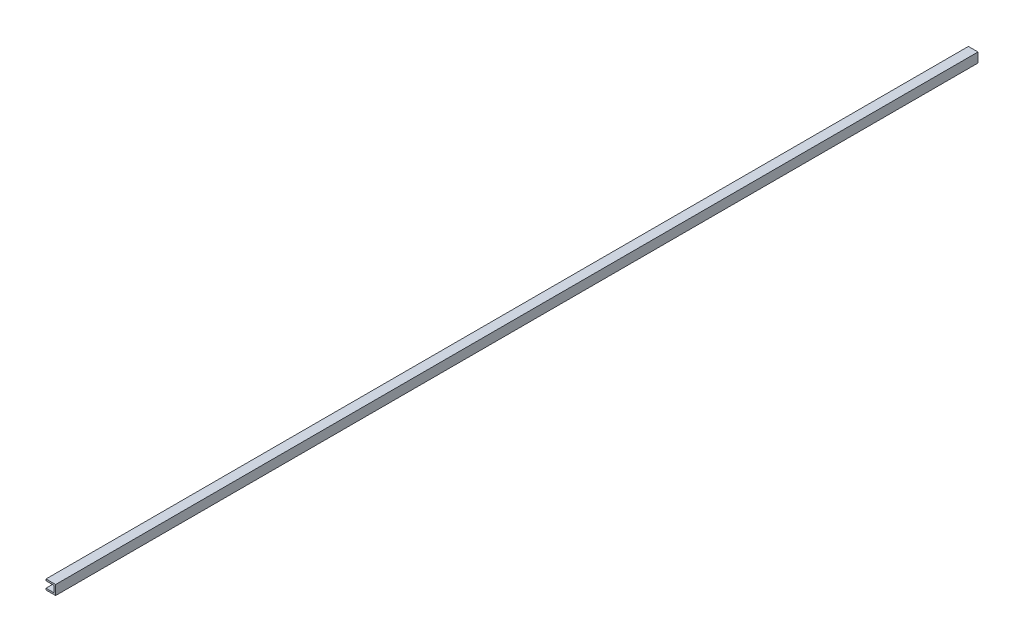
ISO-10303-21;
HEADER;
FILE_DESCRIPTION(('STEP AP214'),'2;1');
FILE_NAME('part.step','',(''),(''),'','','');
FILE_SCHEMA(('AUTOMOTIVE_DESIGN { 1 0 10303 214 1 1 1 1 }'));
ENDSEC;
DATA;
#1=APPLICATION_CONTEXT('core data for automotive mechanical design processes');
#2=APPLICATION_PROTOCOL_DEFINITION('international standard','automotive_design',2000,#1);
#3=PRODUCT_CONTEXT('',#1,'mechanical');
#4=PRODUCT('Part','Part','',(#3));
#5=PRODUCT_RELATED_PRODUCT_CATEGORY('part','',(#4));
#6=PRODUCT_DEFINITION_FORMATION('','',#4);
#7=PRODUCT_DEFINITION_CONTEXT('part definition',#1,'design');
#8=PRODUCT_DEFINITION('design','',#6,#7);
#9=PRODUCT_DEFINITION_SHAPE('','',#8);
#10=(LENGTH_UNIT() NAMED_UNIT(*) SI_UNIT(.MILLI.,.METRE.));
#11=(NAMED_UNIT(*) PLANE_ANGLE_UNIT() SI_UNIT($,.RADIAN.));
#12=(NAMED_UNIT(*) SI_UNIT($,.STERADIAN.) SOLID_ANGLE_UNIT());
#13=UNCERTAINTY_MEASURE_WITH_UNIT(LENGTH_MEASURE(1.E-05),#10,'distance_accuracy_value','');
#14=(GEOMETRIC_REPRESENTATION_CONTEXT(3) GLOBAL_UNCERTAINTY_ASSIGNED_CONTEXT((#13)) GLOBAL_UNIT_ASSIGNED_CONTEXT((#10,
#11,#12)) REPRESENTATION_CONTEXT('',''));
#15=CARTESIAN_POINT('',(0.,0.,0.));
#16=DIRECTION('',(0.,0.,1.));
#17=DIRECTION('',(1.,0.,0.));
#18=AXIS2_PLACEMENT_3D('',#15,#16,#17);
#19=CARTESIAN_POINT('',(-16.8284787136374,19.5792892826044,0.));
#20=DIRECTION('',(0.,1.,0.));
#21=DIRECTION('',(0.,0.,1.));
#22=AXIS2_PLACEMENT_3D('',#19,#20,#21);
#23=PLANE('',#22);
#24=DIRECTION('',(1.,0.,0.));
#25=VECTOR('',#24,1.);
#26=CARTESIAN_POINT('',(-7.30347871363741,19.5792892826044,1828.8));
#27=LINE('',#26,#25);
#28=CARTESIAN_POINT('',(2.22152128636259,19.5792892826044,1828.8));
#29=VERTEX_POINT('',#28);
#30=CARTESIAN_POINT('',(-16.8284787136374,19.5792892826044,1828.8));
#31=VERTEX_POINT('',#30);
#32=EDGE_CURVE('E127',#29,#31,#27,.F.);
#33=ORIENTED_EDGE('',*,*,#32,.F.);
#34=DIRECTION('',(0.,0.,-1.));
#35=VECTOR('',#34,1.);
#36=CARTESIAN_POINT('',(2.22152128636259,19.5792892826044,0.));
#37=LINE('',#36,#35);
#38=CARTESIAN_POINT('',(2.22152128636259,19.5792892826044,0.));
#39=VERTEX_POINT('',#38);
#40=EDGE_CURVE('E122',#39,#29,#37,.F.);
#41=ORIENTED_EDGE('',*,*,#40,.F.);
#42=DIRECTION('',(1.,0.,0.));
#43=VECTOR('',#42,1.);
#44=CARTESIAN_POINT('',(-7.30347871363741,19.5792892826044,0.));
#45=LINE('',#44,#43);
#46=CARTESIAN_POINT('',(-16.8284787136374,19.5792892826044,0.));
#47=VERTEX_POINT('',#46);
#48=EDGE_CURVE('E105',#39,#47,#45,.F.);
#49=ORIENTED_EDGE('',*,*,#48,.T.);
#50=DIRECTION('',(0.,0.,1.));
#51=VECTOR('',#50,1.);
#52=CARTESIAN_POINT('',(-16.8284787136374,19.5792892826044,0.));
#53=LINE('',#52,#51);
#54=EDGE_CURVE('E20',#31,#47,#53,.F.);
#55=ORIENTED_EDGE('',*,*,#54,.F.);
#56=EDGE_LOOP('',(#33,#41,#49,#55));
#57=FACE_BOUND('',#56,.T.);
#58=ADVANCED_FACE('F17',(#57),#23,.T.);
#59=CARTESIAN_POINT('',(-16.8284787136374,16.4042892826044,0.));
#60=DIRECTION('',(-1.,0.,0.));
#61=DIRECTION('',(0.,0.,1.));
#62=AXIS2_PLACEMENT_3D('',#59,#60,#61);
#63=PLANE('',#62);
#64=DIRECTION('',(0.,0.,1.));
#65=VECTOR('',#64,1.);
#66=CARTESIAN_POINT('',(-16.8284787136374,16.4042892826044,0.));
#67=LINE('',#66,#65);
#68=CARTESIAN_POINT('',(-16.8284787136374,16.4042892826044,0.));
#69=VERTEX_POINT('',#68);
#70=CARTESIAN_POINT('',(-16.8284787136374,16.4042892826044,1828.8));
#71=VERTEX_POINT('',#70);
#72=EDGE_CURVE('E79',#69,#71,#67,.T.);
#73=ORIENTED_EDGE('',*,*,#72,.T.);
#74=DIRECTION('',(0.,1.,0.));
#75=VECTOR('',#74,1.);
#76=CARTESIAN_POINT('',(-16.8284787136374,10.0542892826044,1828.8));
#77=LINE('',#76,#75);
#78=EDGE_CURVE('E115',#31,#71,#77,.F.);
#79=ORIENTED_EDGE('',*,*,#78,.F.);
#80=ORIENTED_EDGE('',*,*,#54,.T.);
#81=DIRECTION('',(0.,1.,0.));
#82=VECTOR('',#81,1.);
#83=CARTESIAN_POINT('',(-16.8284787136374,10.0542892826044,0.));
#84=LINE('',#83,#82);
#85=EDGE_CURVE('E113',#47,#69,#84,.F.);
#86=ORIENTED_EDGE('',*,*,#85,.T.);
#87=EDGE_LOOP('',(#73,#79,#80,#86));
#88=FACE_BOUND('',#87,.T.);
#89=ADVANCED_FACE('F112',(#88),#63,.T.);
#90=CARTESIAN_POINT('',(-16.8284787136374,16.4042892826044,0.));
#91=DIRECTION('',(0.,1.,0.));
#92=DIRECTION('',(0.,0.,1.));
#93=AXIS2_PLACEMENT_3D('',#90,#91,#92);
#94=PLANE('',#93);
#95=DIRECTION('',(1.,0.,0.));
#96=VECTOR('',#95,1.);
#97=CARTESIAN_POINT('',(-7.30347871363741,16.4042892826044,0.));
#98=LINE('',#97,#96);
#99=CARTESIAN_POINT('',(-0.953478713637413,16.4042892826044,0.));
#100=VERTEX_POINT('',#99);
#101=EDGE_CURVE('E82',#69,#100,#98,.T.);
#102=ORIENTED_EDGE('',*,*,#101,.T.);
#103=DIRECTION('',(0.,0.,-1.));
#104=VECTOR('',#103,1.);
#105=CARTESIAN_POINT('',(-0.953478713637413,16.4042892826044,0.));
#106=LINE('',#105,#104);
#107=CARTESIAN_POINT('',(-0.953478713637413,16.4042892826044,1828.8));
#108=VERTEX_POINT('',#107);
#109=EDGE_CURVE('E85',#100,#108,#106,.F.);
#110=ORIENTED_EDGE('',*,*,#109,.T.);
#111=DIRECTION('',(1.,0.,0.));
#112=VECTOR('',#111,1.);
#113=CARTESIAN_POINT('',(-7.30347871363741,16.4042892826044,1828.8));
#114=LINE('',#113,#112);
#115=EDGE_CURVE('E130',#71,#108,#114,.T.);
#116=ORIENTED_EDGE('',*,*,#115,.F.);
#117=ORIENTED_EDGE('',*,*,#72,.F.);
#118=EDGE_LOOP('',(#102,#110,#116,#117));
#119=FACE_BOUND('',#118,.T.);
#120=ADVANCED_FACE('F84',(#119),#94,.F.);
#121=CARTESIAN_POINT('',(-0.953478713637413,16.4042892826044,0.));
#122=DIRECTION('',(1.,0.,0.));
#123=DIRECTION('',(0.,0.,-1.));
#124=AXIS2_PLACEMENT_3D('',#121,#122,#123);
#125=PLANE('',#124);
#126=DIRECTION('',(0.,1.,0.));
#127=VECTOR('',#126,1.);
#128=CARTESIAN_POINT('',(-0.953478713637413,10.0542892826044,0.));
#129=LINE('',#128,#127);
#130=CARTESIAN_POINT('',(-0.953478713637413,3.70428928260443,0.));
#131=VERTEX_POINT('',#130);
#132=EDGE_CURVE('E90',#100,#131,#129,.F.);
#133=ORIENTED_EDGE('',*,*,#132,.T.);
#134=DIRECTION('',(0.,0.,-1.));
#135=VECTOR('',#134,1.);
#136=CARTESIAN_POINT('',(-0.953478713637413,3.70428928260443,0.));
#137=LINE('',#136,#135);
#138=CARTESIAN_POINT('',(-0.953478713637413,3.70428928260443,1828.8));
#139=VERTEX_POINT('',#138);
#140=EDGE_CURVE('E91',#131,#139,#137,.F.);
#141=ORIENTED_EDGE('',*,*,#140,.T.);
#142=DIRECTION('',(0.,1.,0.));
#143=VECTOR('',#142,1.);
#144=CARTESIAN_POINT('',(-0.953478713637413,10.0542892826044,1828.8));
#145=LINE('',#144,#143);
#146=EDGE_CURVE('E97',#108,#139,#145,.F.);
#147=ORIENTED_EDGE('',*,*,#146,.F.);
#148=ORIENTED_EDGE('',*,*,#109,.F.);
#149=EDGE_LOOP('',(#133,#141,#147,#148));
#150=FACE_BOUND('',#149,.T.);
#151=ADVANCED_FACE('F94',(#150),#125,.F.);
#152=CARTESIAN_POINT('',(-0.953478713637413,3.70428928260443,0.));
#153=DIRECTION('',(0.,-1.,0.));
#154=DIRECTION('',(0.,0.,-1.));
#155=AXIS2_PLACEMENT_3D('',#152,#153,#154);
#156=PLANE('',#155);
#157=DIRECTION('',(1.,0.,0.));
#158=VECTOR('',#157,1.);
#159=CARTESIAN_POINT('',(-7.30347871363741,3.70428928260443,0.));
#160=LINE('',#159,#158);
#161=CARTESIAN_POINT('',(-16.8284787136374,3.70428928260443,0.));
#162=VERTEX_POINT('',#161);
#163=EDGE_CURVE('E103',#131,#162,#160,.F.);
#164=ORIENTED_EDGE('',*,*,#163,.T.);
#165=DIRECTION('',(0.,0.,1.));
#166=VECTOR('',#165,1.);
#167=CARTESIAN_POINT('',(-16.8284787136374,3.70428928260443,0.));
#168=LINE('',#167,#166);
#169=CARTESIAN_POINT('',(-16.8284787136374,3.70428928260443,1828.8));
#170=VERTEX_POINT('',#169);
#171=EDGE_CURVE('E139',#170,#162,#168,.F.);
#172=ORIENTED_EDGE('',*,*,#171,.F.);
#173=DIRECTION('',(1.,0.,0.));
#174=VECTOR('',#173,1.);
#175=CARTESIAN_POINT('',(-7.30347871363741,3.70428928260443,1828.8));
#176=LINE('',#175,#174);
#177=EDGE_CURVE('E133',#139,#170,#176,.F.);
#178=ORIENTED_EDGE('',*,*,#177,.F.);
#179=ORIENTED_EDGE('',*,*,#140,.F.);
#180=EDGE_LOOP('',(#164,#172,#178,#179));
#181=FACE_BOUND('',#180,.T.);
#182=ADVANCED_FACE('F178',(#181),#156,.F.);
#183=CARTESIAN_POINT('',(-7.30347871363741,10.0542892826044,0.));
#184=DIRECTION('',(0.,0.,1.));
#185=DIRECTION('',(1.,0.,0.));
#186=AXIS2_PLACEMENT_3D('',#183,#184,#185);
#187=PLANE('',#186);
#188=ORIENTED_EDGE('',*,*,#48,.F.);
#189=DIRECTION('',(0.,1.,0.));
#190=VECTOR('',#189,1.);
#191=CARTESIAN_POINT('',(2.22152128636259,19.5792892826044,0.));
#192=LINE('',#191,#190);
#193=CARTESIAN_POINT('',(2.22152128636259,0.529289282604433,0.));
#194=VERTEX_POINT('',#193);
#195=EDGE_CURVE('E119',#194,#39,#192,.T.);
#196=ORIENTED_EDGE('',*,*,#195,.F.);
#197=DIRECTION('',(1.,0.,0.));
#198=VECTOR('',#197,1.);
#199=CARTESIAN_POINT('',(2.22152128636259,0.529289282604433,0.));
#200=LINE('',#199,#198);
#201=CARTESIAN_POINT('',(-16.8284787136374,0.529289282604433,0.));
#202=VERTEX_POINT('',#201);
#203=EDGE_CURVE('E145',#202,#194,#200,.T.);
#204=ORIENTED_EDGE('',*,*,#203,.F.);
#205=DIRECTION('',(0.,1.,0.));
#206=VECTOR('',#205,1.);
#207=CARTESIAN_POINT('',(-16.8284787136374,16.4042892826044,0.));
#208=LINE('',#207,#206);
#209=EDGE_CURVE('E142',#162,#202,#208,.F.);
#210=ORIENTED_EDGE('',*,*,#209,.F.);
#211=ORIENTED_EDGE('',*,*,#163,.F.);
#212=ORIENTED_EDGE('',*,*,#132,.F.);
#213=ORIENTED_EDGE('',*,*,#101,.F.);
#214=ORIENTED_EDGE('',*,*,#85,.F.);
#215=EDGE_LOOP('',(#188,#196,#204,#210,#211,#212,#213,#214));
#216=FACE_BOUND('',#215,.T.);
#217=ADVANCED_FACE('F101',(#216),#187,.F.);
#218=CARTESIAN_POINT('',(2.22152128636259,19.5792892826044,0.));
#219=DIRECTION('',(1.,0.,0.));
#220=DIRECTION('',(0.,0.,-1.));
#221=AXIS2_PLACEMENT_3D('',#218,#219,#220);
#222=PLANE('',#221);
#223=DIRECTION('',(0.,1.,0.));
#224=VECTOR('',#223,1.);
#225=CARTESIAN_POINT('',(2.22152128636259,10.0542892826044,1828.8));
#226=LINE('',#225,#224);
#227=CARTESIAN_POINT('',(2.22152128636259,0.529289282604432,1828.8));
#228=VERTEX_POINT('',#227);
#229=EDGE_CURVE('E135',#228,#29,#226,.T.);
#230=ORIENTED_EDGE('',*,*,#229,.F.);
#231=DIRECTION('',(0.,0.,-1.));
#232=VECTOR('',#231,1.);
#233=CARTESIAN_POINT('',(2.22152128636259,0.529289282604433,0.));
#234=LINE('',#233,#232);
#235=EDGE_CURVE('E148',#194,#228,#234,.F.);
#236=ORIENTED_EDGE('',*,*,#235,.F.);
#237=ORIENTED_EDGE('',*,*,#195,.T.);
#238=ORIENTED_EDGE('',*,*,#40,.T.);
#239=EDGE_LOOP('',(#230,#236,#237,#238));
#240=FACE_BOUND('',#239,.T.);
#241=ADVANCED_FACE('F157',(#240),#222,.T.);
#242=CARTESIAN_POINT('',(-7.30347871363741,10.0542892826044,1828.8));
#243=DIRECTION('',(0.,0.,1.));
#244=DIRECTION('',(1.,0.,0.));
#245=AXIS2_PLACEMENT_3D('',#242,#243,#244);
#246=PLANE('',#245);
#247=DIRECTION('',(1.,0.,0.));
#248=VECTOR('',#247,1.);
#249=CARTESIAN_POINT('',(2.22152128636259,0.529289282604433,1828.8));
#250=LINE('',#249,#248);
#251=CARTESIAN_POINT('',(-16.8284787136374,0.529289282604433,1828.8));
#252=VERTEX_POINT('',#251);
#253=EDGE_CURVE('E26',#228,#252,#250,.F.);
#254=ORIENTED_EDGE('',*,*,#253,.F.);
#255=ORIENTED_EDGE('',*,*,#229,.T.);
#256=ORIENTED_EDGE('',*,*,#32,.T.);
#257=ORIENTED_EDGE('',*,*,#78,.T.);
#258=ORIENTED_EDGE('',*,*,#115,.T.);
#259=ORIENTED_EDGE('',*,*,#146,.T.);
#260=ORIENTED_EDGE('',*,*,#177,.T.);
#261=DIRECTION('',(0.,1.,0.));
#262=VECTOR('',#261,1.);
#263=CARTESIAN_POINT('',(-16.8284787136374,16.4042892826044,1828.8));
#264=LINE('',#263,#262);
#265=EDGE_CURVE('E35',#252,#170,#264,.T.);
#266=ORIENTED_EDGE('',*,*,#265,.F.);
#267=EDGE_LOOP('',(#254,#255,#256,#257,#258,#259,#260,#266));
#268=FACE_BOUND('',#267,.T.);
#269=ADVANCED_FACE('F155',(#268),#246,.T.);
#270=CARTESIAN_POINT('',(-16.8284787136374,16.4042892826044,0.));
#271=DIRECTION('',(-1.,0.,0.));
#272=DIRECTION('',(0.,0.,1.));
#273=AXIS2_PLACEMENT_3D('',#270,#271,#272);
#274=PLANE('',#273);
#275=ORIENTED_EDGE('',*,*,#171,.T.);
#276=ORIENTED_EDGE('',*,*,#209,.T.);
#277=DIRECTION('',(0.,0.,-1.));
#278=VECTOR('',#277,1.);
#279=CARTESIAN_POINT('',(-16.8284787136374,0.529289282604433,0.));
#280=LINE('',#279,#278);
#281=EDGE_CURVE('E11',#252,#202,#280,.T.);
#282=ORIENTED_EDGE('',*,*,#281,.F.);
#283=ORIENTED_EDGE('',*,*,#265,.T.);
#284=EDGE_LOOP('',(#275,#276,#282,#283));
#285=FACE_BOUND('',#284,.T.);
#286=ADVANCED_FACE('F164',(#285),#274,.T.);
#287=CARTESIAN_POINT('',(2.22152128636259,0.529289282604433,0.));
#288=DIRECTION('',(0.,-1.,0.));
#289=DIRECTION('',(0.,0.,-1.));
#290=AXIS2_PLACEMENT_3D('',#287,#288,#289);
#291=PLANE('',#290);
#292=ORIENTED_EDGE('',*,*,#253,.T.);
#293=ORIENTED_EDGE('',*,*,#281,.T.);
#294=ORIENTED_EDGE('',*,*,#203,.T.);
#295=ORIENTED_EDGE('',*,*,#235,.T.);
#296=EDGE_LOOP('',(#292,#293,#294,#295));
#297=FACE_BOUND('',#296,.T.);
#298=ADVANCED_FACE('F153',(#297),#291,.T.);
#299=CLOSED_SHELL('',(#58,#89,#120,#151,#182,#217,#241,#269,#286,#298));
#300=MANIFOLD_SOLID_BREP('B1',#299);
#301=ADVANCED_BREP_SHAPE_REPRESENTATION('',(#18,#300),#14);
#302=SHAPE_DEFINITION_REPRESENTATION(#9,#301);
ENDSEC;
END-ISO-10303-21;
